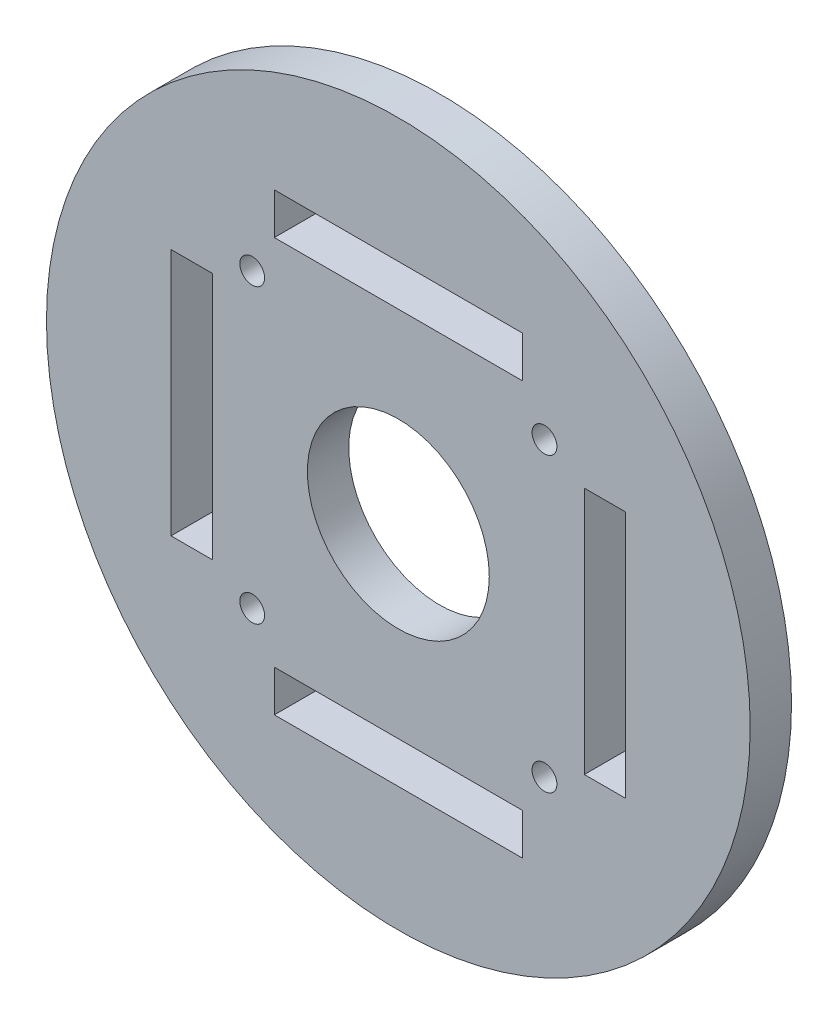
ISO-10303-21;
HEADER;
FILE_DESCRIPTION(('STEP AP214'),'2;1');
FILE_NAME('part.step','',(''),(''),'','','');
FILE_SCHEMA(('AUTOMOTIVE_DESIGN { 1 0 10303 214 1 1 1 1 }'));
ENDSEC;
DATA;
#1=APPLICATION_CONTEXT('core data for automotive mechanical design processes');
#2=APPLICATION_PROTOCOL_DEFINITION('international standard','automotive_design',2000,#1);
#3=PRODUCT_CONTEXT('',#1,'mechanical');
#4=PRODUCT('Part','Part','',(#3));
#5=PRODUCT_RELATED_PRODUCT_CATEGORY('part','',(#4));
#6=PRODUCT_DEFINITION_FORMATION('','',#4);
#7=PRODUCT_DEFINITION_CONTEXT('part definition',#1,'design');
#8=PRODUCT_DEFINITION('design','',#6,#7);
#9=PRODUCT_DEFINITION_SHAPE('','',#8);
#10=(LENGTH_UNIT() NAMED_UNIT(*) SI_UNIT(.MILLI.,.METRE.));
#11=(NAMED_UNIT(*) PLANE_ANGLE_UNIT() SI_UNIT($,.RADIAN.));
#12=(NAMED_UNIT(*) SI_UNIT($,.STERADIAN.) SOLID_ANGLE_UNIT());
#13=UNCERTAINTY_MEASURE_WITH_UNIT(LENGTH_MEASURE(1.E-05),#10,'distance_accuracy_value','');
#14=(GEOMETRIC_REPRESENTATION_CONTEXT(3) GLOBAL_UNCERTAINTY_ASSIGNED_CONTEXT((#13)) GLOBAL_UNIT_ASSIGNED_CONTEXT((#10,
#11,#12)) REPRESENTATION_CONTEXT('',''));
#15=CARTESIAN_POINT('',(0.,0.,0.));
#16=DIRECTION('',(0.,0.,1.));
#17=DIRECTION('',(1.,0.,0.));
#18=AXIS2_PLACEMENT_3D('',#15,#16,#17);
#19=CARTESIAN_POINT('',(0.,0.,5.));
#20=DIRECTION('',(0.,0.,1.));
#21=DIRECTION('',(1.,0.,0.));
#22=AXIS2_PLACEMENT_3D('',#19,#20,#21);
#23=PLANE('',#22);
#24=CARTESIAN_POINT('',(-17.6776695296637,17.6776695296637,5.));
#25=DIRECTION('',(0.,0.,1.));
#26=DIRECTION('',(1.,0.,0.));
#27=AXIS2_PLACEMENT_3D('',#24,#25,#26);
#28=CIRCLE('',#27,1.5);
#29=CARTESIAN_POINT('',(-16.1776695296637,17.6776695296637,5.));
#30=VERTEX_POINT('',#29);
#31=EDGE_CURVE('E323',#30,#30,#28,.T.);
#32=ORIENTED_EDGE('',*,*,#31,.F.);
#33=EDGE_LOOP('',(#32));
#34=FACE_BOUND('',#33,.T.);
#35=CARTESIAN_POINT('',(-17.6776695296637,-17.6776695296637,5.));
#36=DIRECTION('',(0.,0.,1.));
#37=DIRECTION('',(1.,0.,0.));
#38=AXIS2_PLACEMENT_3D('',#35,#36,#37);
#39=CIRCLE('',#38,1.5);
#40=CARTESIAN_POINT('',(-16.1776695296637,-17.6776695296637,5.));
#41=VERTEX_POINT('',#40);
#42=EDGE_CURVE('E176',#41,#41,#39,.T.);
#43=ORIENTED_EDGE('',*,*,#42,.F.);
#44=EDGE_LOOP('',(#43));
#45=FACE_BOUND('',#44,.T.);
#46=CARTESIAN_POINT('',(17.6776695296637,-17.6776695296637,5.));
#47=DIRECTION('',(0.,0.,1.));
#48=DIRECTION('',(1.,0.,0.));
#49=AXIS2_PLACEMENT_3D('',#46,#47,#48);
#50=CIRCLE('',#49,1.5);
#51=CARTESIAN_POINT('',(19.1776695296637,-17.6776695296637,5.));
#52=VERTEX_POINT('',#51);
#53=EDGE_CURVE('E186',#52,#52,#50,.T.);
#54=ORIENTED_EDGE('',*,*,#53,.F.);
#55=EDGE_LOOP('',(#54));
#56=FACE_BOUND('',#55,.T.);
#57=CARTESIAN_POINT('',(17.6776695296637,17.6776695296637,5.));
#58=DIRECTION('',(0.,0.,1.));
#59=DIRECTION('',(1.,0.,0.));
#60=AXIS2_PLACEMENT_3D('',#57,#58,#59);
#61=CIRCLE('',#60,1.5);
#62=CARTESIAN_POINT('',(19.1776695296637,17.6776695296637,5.));
#63=VERTEX_POINT('',#62);
#64=EDGE_CURVE('E192',#63,#63,#61,.T.);
#65=ORIENTED_EDGE('',*,*,#64,.F.);
#66=EDGE_LOOP('',(#65));
#67=FACE_BOUND('',#66,.T.);
#68=CARTESIAN_POINT('',(0.,0.,5.));
#69=DIRECTION('',(0.,0.,1.));
#70=DIRECTION('',(1.,0.,0.));
#71=AXIS2_PLACEMENT_3D('',#68,#69,#70);
#72=CIRCLE('',#71,11.);
#73=CARTESIAN_POINT('',(11.,0.,5.));
#74=VERTEX_POINT('',#73);
#75=EDGE_CURVE('E291',#74,#74,#72,.T.);
#76=ORIENTED_EDGE('',*,*,#75,.F.);
#77=EDGE_LOOP('',(#76));
#78=FACE_BOUND('',#77,.T.);
#79=CARTESIAN_POINT('',(0.,0.,5.));
#80=DIRECTION('',(0.,0.,1.));
#81=DIRECTION('',(1.,0.,0.));
#82=AXIS2_PLACEMENT_3D('',#79,#80,#81);
#83=CIRCLE('',#82,42.5626609388931);
#84=CARTESIAN_POINT('',(42.5626609388931,0.,5.));
#85=VERTEX_POINT('',#84);
#86=EDGE_CURVE('E11',#85,#85,#83,.T.);
#87=ORIENTED_EDGE('',*,*,#86,.T.);
#88=EDGE_LOOP('',(#87));
#89=FACE_BOUND('',#88,.T.);
#90=DIRECTION('',(1.,0.,0.));
#91=VECTOR('',#90,1.);
#92=CARTESIAN_POINT('',(-27.5,-15.,5.));
#93=LINE('',#92,#91);
#94=CARTESIAN_POINT('',(-27.5,-15.,5.));
#95=VERTEX_POINT('',#94);
#96=CARTESIAN_POINT('',(-22.5,-15.,5.));
#97=VERTEX_POINT('',#96);
#98=EDGE_CURVE('E262',#95,#97,#93,.T.);
#99=ORIENTED_EDGE('',*,*,#98,.F.);
#100=DIRECTION('',(0.,-1.,0.));
#101=VECTOR('',#100,1.);
#102=CARTESIAN_POINT('',(-27.5,15.,5.));
#103=LINE('',#102,#101);
#104=CARTESIAN_POINT('',(-27.5,15.,5.));
#105=VERTEX_POINT('',#104);
#106=EDGE_CURVE('E260',#105,#95,#103,.T.);
#107=ORIENTED_EDGE('',*,*,#106,.F.);
#108=DIRECTION('',(-1.,0.,0.));
#109=VECTOR('',#108,1.);
#110=CARTESIAN_POINT('',(-27.5,15.,5.));
#111=LINE('',#110,#109);
#112=CARTESIAN_POINT('',(-22.5,15.,5.));
#113=VERTEX_POINT('',#112);
#114=EDGE_CURVE('E268',#113,#105,#111,.T.);
#115=ORIENTED_EDGE('',*,*,#114,.F.);
#116=DIRECTION('',(0.,1.,0.));
#117=VECTOR('',#116,1.);
#118=CARTESIAN_POINT('',(-22.5,15.,5.));
#119=LINE('',#118,#117);
#120=EDGE_CURVE('E265',#97,#113,#119,.T.);
#121=ORIENTED_EDGE('',*,*,#120,.F.);
#122=EDGE_LOOP('',(#99,#107,#115,#121));
#123=FACE_BOUND('',#122,.T.);
#124=DIRECTION('',(-1.,0.,0.));
#125=VECTOR('',#124,1.);
#126=CARTESIAN_POINT('',(15.0000000000001,27.4999999999999,5.));
#127=LINE('',#126,#125);
#128=CARTESIAN_POINT('',(15.0000000000001,27.4999999999999,5.));
#129=VERTEX_POINT('',#128);
#130=CARTESIAN_POINT('',(-14.9999999999999,27.5,5.));
#131=VERTEX_POINT('',#130);
#132=EDGE_CURVE('E231',#129,#131,#127,.T.);
#133=ORIENTED_EDGE('',*,*,#132,.F.);
#134=DIRECTION('',(0.,1.,0.));
#135=VECTOR('',#134,1.);
#136=CARTESIAN_POINT('',(15.0000000000001,27.4999999999999,5.));
#137=LINE('',#136,#135);
#138=CARTESIAN_POINT('',(15.0000000000001,22.4999999999999,5.));
#139=VERTEX_POINT('',#138);
#140=EDGE_CURVE('E229',#139,#129,#137,.T.);
#141=ORIENTED_EDGE('',*,*,#140,.F.);
#142=DIRECTION('',(1.,0.,0.));
#143=VECTOR('',#142,1.);
#144=CARTESIAN_POINT('',(15.0000000000001,22.4999999999999,5.));
#145=LINE('',#144,#143);
#146=CARTESIAN_POINT('',(-14.9999999999999,22.5,5.));
#147=VERTEX_POINT('',#146);
#148=EDGE_CURVE('E237',#147,#139,#145,.T.);
#149=ORIENTED_EDGE('',*,*,#148,.F.);
#150=DIRECTION('',(0.,-1.,0.));
#151=VECTOR('',#150,1.);
#152=CARTESIAN_POINT('',(-14.9999999999999,27.5,5.));
#153=LINE('',#152,#151);
#154=EDGE_CURVE('E234',#131,#147,#153,.T.);
#155=ORIENTED_EDGE('',*,*,#154,.F.);
#156=EDGE_LOOP('',(#133,#141,#149,#155));
#157=FACE_BOUND('',#156,.T.);
#158=DIRECTION('',(0.,1.,0.));
#159=VECTOR('',#158,1.);
#160=CARTESIAN_POINT('',(27.4999999999999,-15.0000000000002,5.));
#161=LINE('',#160,#159);
#162=CARTESIAN_POINT('',(27.4999999999999,-15.0000000000002,5.));
#163=VERTEX_POINT('',#162);
#164=CARTESIAN_POINT('',(27.5000000000001,14.9999999999998,5.));
#165=VERTEX_POINT('',#164);
#166=EDGE_CURVE('E200',#163,#165,#161,.T.);
#167=ORIENTED_EDGE('',*,*,#166,.F.);
#168=DIRECTION('',(1.,0.,0.));
#169=VECTOR('',#168,1.);
#170=CARTESIAN_POINT('',(27.4999999999999,-15.0000000000002,5.));
#171=LINE('',#170,#169);
#172=CARTESIAN_POINT('',(22.4999999999999,-15.0000000000002,5.));
#173=VERTEX_POINT('',#172);
#174=EDGE_CURVE('E198',#173,#163,#171,.T.);
#175=ORIENTED_EDGE('',*,*,#174,.F.);
#176=DIRECTION('',(0.,-1.,0.));
#177=VECTOR('',#176,1.);
#178=CARTESIAN_POINT('',(22.4999999999999,-15.0000000000002,5.));
#179=LINE('',#178,#177);
#180=CARTESIAN_POINT('',(22.5000000000001,14.9999999999999,5.));
#181=VERTEX_POINT('',#180);
#182=EDGE_CURVE('E206',#181,#173,#179,.T.);
#183=ORIENTED_EDGE('',*,*,#182,.F.);
#184=DIRECTION('',(-1.,0.,0.));
#185=VECTOR('',#184,1.);
#186=CARTESIAN_POINT('',(27.5000000000001,14.9999999999998,5.));
#187=LINE('',#186,#185);
#188=EDGE_CURVE('E203',#165,#181,#187,.T.);
#189=ORIENTED_EDGE('',*,*,#188,.F.);
#190=EDGE_LOOP('',(#167,#175,#183,#189));
#191=FACE_BOUND('',#190,.T.);
#192=DIRECTION('',(1.,0.,0.));
#193=VECTOR('',#192,1.);
#194=CARTESIAN_POINT('',(-15.0000000000003,-27.4999999999998,5.));
#195=LINE('',#194,#193);
#196=CARTESIAN_POINT('',(-15.0000000000003,-27.4999999999998,5.));
#197=VERTEX_POINT('',#196);
#198=CARTESIAN_POINT('',(14.9999999999997,-27.5000000000001,5.));
#199=VERTEX_POINT('',#198);
#200=EDGE_CURVE('E156',#197,#199,#195,.T.);
#201=ORIENTED_EDGE('',*,*,#200,.F.);
#202=DIRECTION('',(0.,-1.,0.));
#203=VECTOR('',#202,1.);
#204=CARTESIAN_POINT('',(-15.0000000000003,-27.4999999999998,5.));
#205=LINE('',#204,#203);
#206=CARTESIAN_POINT('',(-15.0000000000002,-22.4999999999998,5.));
#207=VERTEX_POINT('',#206);
#208=EDGE_CURVE('E148',#207,#197,#205,.T.);
#209=ORIENTED_EDGE('',*,*,#208,.F.);
#210=DIRECTION('',(-1.,0.,0.));
#211=VECTOR('',#210,1.);
#212=CARTESIAN_POINT('',(-15.0000000000002,-22.4999999999998,5.));
#213=LINE('',#212,#211);
#214=CARTESIAN_POINT('',(14.9999999999998,-22.5000000000002,5.));
#215=VERTEX_POINT('',#214);
#216=EDGE_CURVE('E170',#215,#207,#213,.T.);
#217=ORIENTED_EDGE('',*,*,#216,.F.);
#218=DIRECTION('',(0.,1.,0.));
#219=VECTOR('',#218,1.);
#220=CARTESIAN_POINT('',(14.9999999999997,-27.5000000000001,5.));
#221=LINE('',#220,#219);
#222=EDGE_CURVE('E168',#199,#215,#221,.T.);
#223=ORIENTED_EDGE('',*,*,#222,.F.);
#224=EDGE_LOOP('',(#201,#209,#217,#223));
#225=FACE_BOUND('',#224,.T.);
#226=ADVANCED_FACE('F35',(#34,#45,#56,#67,#78,#89,#123,#157,#191,#225),#23,.T.);
#227=CARTESIAN_POINT('',(0.,0.,0.));
#228=DIRECTION('',(0.,0.,1.));
#229=DIRECTION('',(1.,0.,0.));
#230=AXIS2_PLACEMENT_3D('',#227,#228,#229);
#231=PLANE('',#230);
#232=CARTESIAN_POINT('',(-17.6776695296637,17.6776695296637,0.));
#233=DIRECTION('',(0.,0.,1.));
#234=DIRECTION('',(1.,0.,0.));
#235=AXIS2_PLACEMENT_3D('',#232,#233,#234);
#236=CIRCLE('',#235,1.5);
#237=CARTESIAN_POINT('',(-16.1776695296637,17.6776695296637,0.));
#238=VERTEX_POINT('',#237);
#239=EDGE_CURVE('E531',#238,#238,#236,.T.);
#240=ORIENTED_EDGE('',*,*,#239,.T.);
#241=EDGE_LOOP('',(#240));
#242=FACE_BOUND('',#241,.T.);
#243=CARTESIAN_POINT('',(-17.6776695296637,-17.6776695296637,0.));
#244=DIRECTION('',(0.,0.,1.));
#245=DIRECTION('',(1.,0.,0.));
#246=AXIS2_PLACEMENT_3D('',#243,#244,#245);
#247=CIRCLE('',#246,1.5);
#248=CARTESIAN_POINT('',(-16.1776695296637,-17.6776695296637,0.));
#249=VERTEX_POINT('',#248);
#250=EDGE_CURVE('E533',#249,#249,#247,.T.);
#251=ORIENTED_EDGE('',*,*,#250,.T.);
#252=EDGE_LOOP('',(#251));
#253=FACE_BOUND('',#252,.T.);
#254=DIRECTION('',(1.,0.,0.));
#255=VECTOR('',#254,1.);
#256=CARTESIAN_POINT('',(27.4999999999999,-15.0000000000002,0.));
#257=LINE('',#256,#255);
#258=CARTESIAN_POINT('',(22.4999999999999,-15.0000000000002,0.));
#259=VERTEX_POINT('',#258);
#260=CARTESIAN_POINT('',(27.4999999999999,-15.0000000000002,0.));
#261=VERTEX_POINT('',#260);
#262=EDGE_CURVE('E195',#259,#261,#257,.T.);
#263=ORIENTED_EDGE('',*,*,#262,.T.);
#264=DIRECTION('',(0.,1.,0.));
#265=VECTOR('',#264,1.);
#266=CARTESIAN_POINT('',(27.4999999999999,-15.0000000000002,0.));
#267=LINE('',#266,#265);
#268=CARTESIAN_POINT('',(27.5000000000001,14.9999999999998,0.));
#269=VERTEX_POINT('',#268);
#270=EDGE_CURVE('E211',#261,#269,#267,.T.);
#271=ORIENTED_EDGE('',*,*,#270,.T.);
#272=DIRECTION('',(-1.,0.,0.));
#273=VECTOR('',#272,1.);
#274=CARTESIAN_POINT('',(27.5000000000001,14.9999999999998,0.));
#275=LINE('',#274,#273);
#276=CARTESIAN_POINT('',(22.5000000000001,14.9999999999999,0.));
#277=VERTEX_POINT('',#276);
#278=EDGE_CURVE('E214',#269,#277,#275,.T.);
#279=ORIENTED_EDGE('',*,*,#278,.T.);
#280=DIRECTION('',(0.,-1.,0.));
#281=VECTOR('',#280,1.);
#282=CARTESIAN_POINT('',(22.4999999999999,-15.0000000000002,0.));
#283=LINE('',#282,#281);
#284=EDGE_CURVE('E201',#277,#259,#283,.T.);
#285=ORIENTED_EDGE('',*,*,#284,.T.);
#286=EDGE_LOOP('',(#263,#271,#279,#285));
#287=FACE_BOUND('',#286,.T.);
#288=DIRECTION('',(0.,-1.,0.));
#289=VECTOR('',#288,1.);
#290=CARTESIAN_POINT('',(-27.5,15.,0.));
#291=LINE('',#290,#289);
#292=CARTESIAN_POINT('',(-27.5,15.,0.));
#293=VERTEX_POINT('',#292);
#294=CARTESIAN_POINT('',(-27.5,-15.,0.));
#295=VERTEX_POINT('',#294);
#296=EDGE_CURVE('E259',#293,#295,#291,.T.);
#297=ORIENTED_EDGE('',*,*,#296,.T.);
#298=DIRECTION('',(1.,0.,0.));
#299=VECTOR('',#298,1.);
#300=CARTESIAN_POINT('',(-27.5,-15.,0.));
#301=LINE('',#300,#299);
#302=CARTESIAN_POINT('',(-22.5,-15.,0.));
#303=VERTEX_POINT('',#302);
#304=EDGE_CURVE('E273',#295,#303,#301,.T.);
#305=ORIENTED_EDGE('',*,*,#304,.T.);
#306=DIRECTION('',(0.,1.,0.));
#307=VECTOR('',#306,1.);
#308=CARTESIAN_POINT('',(-22.5,15.,0.));
#309=LINE('',#308,#307);
#310=CARTESIAN_POINT('',(-22.5,15.,0.));
#311=VERTEX_POINT('',#310);
#312=EDGE_CURVE('E276',#303,#311,#309,.T.);
#313=ORIENTED_EDGE('',*,*,#312,.T.);
#314=DIRECTION('',(-1.,0.,0.));
#315=VECTOR('',#314,1.);
#316=CARTESIAN_POINT('',(-27.5,15.,0.));
#317=LINE('',#316,#315);
#318=EDGE_CURVE('E263',#311,#293,#317,.T.);
#319=ORIENTED_EDGE('',*,*,#318,.T.);
#320=EDGE_LOOP('',(#297,#305,#313,#319));
#321=FACE_BOUND('',#320,.T.);
#322=CARTESIAN_POINT('',(0.,0.,0.));
#323=DIRECTION('',(0.,0.,1.));
#324=DIRECTION('',(1.,0.,0.));
#325=AXIS2_PLACEMENT_3D('',#322,#323,#324);
#326=CIRCLE('',#325,11.);
#327=CARTESIAN_POINT('',(11.,0.,0.));
#328=VERTEX_POINT('',#327);
#329=EDGE_CURVE('E290',#328,#328,#326,.T.);
#330=ORIENTED_EDGE('',*,*,#329,.T.);
#331=EDGE_LOOP('',(#330));
#332=FACE_BOUND('',#331,.T.);
#333=CARTESIAN_POINT('',(0.,0.,0.));
#334=DIRECTION('',(0.,0.,1.));
#335=DIRECTION('',(1.,0.,0.));
#336=AXIS2_PLACEMENT_3D('',#333,#334,#335);
#337=CIRCLE('',#336,42.5626609388931);
#338=CARTESIAN_POINT('',(42.5626609388931,0.,0.));
#339=VERTEX_POINT('',#338);
#340=EDGE_CURVE('E39',#339,#339,#337,.T.);
#341=ORIENTED_EDGE('',*,*,#340,.F.);
#342=EDGE_LOOP('',(#341));
#343=FACE_BOUND('',#342,.T.);
#344=DIRECTION('',(0.,1.,0.));
#345=VECTOR('',#344,1.);
#346=CARTESIAN_POINT('',(15.0000000000001,27.4999999999999,0.));
#347=LINE('',#346,#345);
#348=CARTESIAN_POINT('',(15.0000000000001,22.4999999999999,0.));
#349=VERTEX_POINT('',#348);
#350=CARTESIAN_POINT('',(15.0000000000001,27.4999999999999,0.));
#351=VERTEX_POINT('',#350);
#352=EDGE_CURVE('E228',#349,#351,#347,.T.);
#353=ORIENTED_EDGE('',*,*,#352,.T.);
#354=DIRECTION('',(-1.,0.,0.));
#355=VECTOR('',#354,1.);
#356=CARTESIAN_POINT('',(15.0000000000001,27.4999999999999,0.));
#357=LINE('',#356,#355);
#358=CARTESIAN_POINT('',(-14.9999999999999,27.5,0.));
#359=VERTEX_POINT('',#358);
#360=EDGE_CURVE('E242',#351,#359,#357,.T.);
#361=ORIENTED_EDGE('',*,*,#360,.T.);
#362=DIRECTION('',(0.,-1.,0.));
#363=VECTOR('',#362,1.);
#364=CARTESIAN_POINT('',(-14.9999999999999,27.5,0.));
#365=LINE('',#364,#363);
#366=CARTESIAN_POINT('',(-14.9999999999999,22.5,0.));
#367=VERTEX_POINT('',#366);
#368=EDGE_CURVE('E245',#359,#367,#365,.T.);
#369=ORIENTED_EDGE('',*,*,#368,.T.);
#370=DIRECTION('',(1.,0.,0.));
#371=VECTOR('',#370,1.);
#372=CARTESIAN_POINT('',(15.0000000000001,22.4999999999999,0.));
#373=LINE('',#372,#371);
#374=EDGE_CURVE('E232',#367,#349,#373,.T.);
#375=ORIENTED_EDGE('',*,*,#374,.T.);
#376=EDGE_LOOP('',(#353,#361,#369,#375));
#377=FACE_BOUND('',#376,.T.);
#378=CARTESIAN_POINT('',(17.6776695296637,17.6776695296637,0.));
#379=DIRECTION('',(0.,0.,1.));
#380=DIRECTION('',(1.,0.,0.));
#381=AXIS2_PLACEMENT_3D('',#378,#379,#380);
#382=CIRCLE('',#381,1.5);
#383=CARTESIAN_POINT('',(19.1776695296637,17.6776695296637,0.));
#384=VERTEX_POINT('',#383);
#385=EDGE_CURVE('E189',#384,#384,#382,.T.);
#386=ORIENTED_EDGE('',*,*,#385,.T.);
#387=EDGE_LOOP('',(#386));
#388=FACE_BOUND('',#387,.T.);
#389=CARTESIAN_POINT('',(17.6776695296637,-17.6776695296637,0.));
#390=DIRECTION('',(0.,0.,1.));
#391=DIRECTION('',(1.,0.,0.));
#392=AXIS2_PLACEMENT_3D('',#389,#390,#391);
#393=CIRCLE('',#392,1.5);
#394=CARTESIAN_POINT('',(19.1776695296637,-17.6776695296637,0.));
#395=VERTEX_POINT('',#394);
#396=EDGE_CURVE('E164',#395,#395,#393,.T.);
#397=ORIENTED_EDGE('',*,*,#396,.T.);
#398=EDGE_LOOP('',(#397));
#399=FACE_BOUND('',#398,.T.);
#400=DIRECTION('',(0.,-1.,0.));
#401=VECTOR('',#400,1.);
#402=CARTESIAN_POINT('',(-15.0000000000003,-27.4999999999998,0.));
#403=LINE('',#402,#401);
#404=CARTESIAN_POINT('',(-15.0000000000002,-22.4999999999998,0.));
#405=VERTEX_POINT('',#404);
#406=CARTESIAN_POINT('',(-15.0000000000003,-27.4999999999998,0.));
#407=VERTEX_POINT('',#406);
#408=EDGE_CURVE('E58',#405,#407,#403,.T.);
#409=ORIENTED_EDGE('',*,*,#408,.T.);
#410=DIRECTION('',(1.,0.,0.));
#411=VECTOR('',#410,1.);
#412=CARTESIAN_POINT('',(-15.0000000000003,-27.4999999999998,0.));
#413=LINE('',#412,#411);
#414=CARTESIAN_POINT('',(14.9999999999997,-27.5000000000001,0.));
#415=VERTEX_POINT('',#414);
#416=EDGE_CURVE('E163',#407,#415,#413,.T.);
#417=ORIENTED_EDGE('',*,*,#416,.T.);
#418=DIRECTION('',(0.,1.,0.));
#419=VECTOR('',#418,1.);
#420=CARTESIAN_POINT('',(14.9999999999997,-27.5000000000001,0.));
#421=LINE('',#420,#419);
#422=CARTESIAN_POINT('',(14.9999999999998,-22.5000000000001,0.));
#423=VERTEX_POINT('',#422);
#424=EDGE_CURVE('E178',#415,#423,#421,.T.);
#425=ORIENTED_EDGE('',*,*,#424,.T.);
#426=DIRECTION('',(-1.,0.,0.));
#427=VECTOR('',#426,1.);
#428=CARTESIAN_POINT('',(-15.0000000000002,-22.4999999999998,0.));
#429=LINE('',#428,#427);
#430=EDGE_CURVE('E157',#423,#405,#429,.T.);
#431=ORIENTED_EDGE('',*,*,#430,.T.);
#432=EDGE_LOOP('',(#409,#417,#425,#431));
#433=FACE_BOUND('',#432,.T.);
#434=ADVANCED_FACE('F297',(#242,#253,#287,#321,#332,#343,#377,#388,#399,#433),#231,.F.);
#435=CARTESIAN_POINT('',(0.,0.,5.));
#436=DIRECTION('',(0.,0.,-1.));
#437=DIRECTION('',(-1.,0.,0.));
#438=AXIS2_PLACEMENT_3D('',#435,#436,#437);
#439=CYLINDRICAL_SURFACE('',#438,42.5626609388931);
#440=ORIENTED_EDGE('',*,*,#86,.F.);
#441=EDGE_LOOP('',(#440));
#442=FACE_BOUND('',#441,.T.);
#443=ORIENTED_EDGE('',*,*,#340,.T.);
#444=EDGE_LOOP('',(#443));
#445=FACE_BOUND('',#444,.T.);
#446=ADVANCED_FACE('F37',(#442,#445),#439,.T.);
#447=CARTESIAN_POINT('',(0.,0.,5.));
#448=DIRECTION('',(0.,0.,-1.));
#449=DIRECTION('',(-1.,0.,0.));
#450=AXIS2_PLACEMENT_3D('',#447,#448,#449);
#451=CYLINDRICAL_SURFACE('',#450,11.);
#452=ORIENTED_EDGE('',*,*,#75,.T.);
#453=EDGE_LOOP('',(#452));
#454=FACE_BOUND('',#453,.T.);
#455=ORIENTED_EDGE('',*,*,#329,.F.);
#456=EDGE_LOOP('',(#455));
#457=FACE_BOUND('',#456,.T.);
#458=ADVANCED_FACE('F300',(#454,#457),#451,.F.);
#459=CARTESIAN_POINT('',(-27.5,15.,5.));
#460=DIRECTION('',(1.,0.,0.));
#461=DIRECTION('',(0.,1.,0.));
#462=AXIS2_PLACEMENT_3D('',#459,#460,#461);
#463=PLANE('',#462);
#464=ORIENTED_EDGE('',*,*,#296,.F.);
#465=DIRECTION('',(0.,0.,-1.));
#466=VECTOR('',#465,1.);
#467=CARTESIAN_POINT('',(-27.5,15.,5.));
#468=LINE('',#467,#466);
#469=EDGE_CURVE('E270',#105,#293,#468,.T.);
#470=ORIENTED_EDGE('',*,*,#469,.F.);
#471=ORIENTED_EDGE('',*,*,#106,.T.);
#472=DIRECTION('',(0.,0.,-1.));
#473=VECTOR('',#472,1.);
#474=CARTESIAN_POINT('',(-27.5,-15.,5.));
#475=LINE('',#474,#473);
#476=EDGE_CURVE('E287',#95,#295,#475,.T.);
#477=ORIENTED_EDGE('',*,*,#476,.T.);
#478=EDGE_LOOP('',(#464,#470,#471,#477));
#479=FACE_BOUND('',#478,.T.);
#480=ADVANCED_FACE('F302',(#479),#463,.T.);
#481=CARTESIAN_POINT('',(-27.5,-15.,5.));
#482=DIRECTION('',(0.,1.,0.));
#483=DIRECTION('',(-1.,0.,0.));
#484=AXIS2_PLACEMENT_3D('',#481,#482,#483);
#485=PLANE('',#484);
#486=ORIENTED_EDGE('',*,*,#304,.F.);
#487=ORIENTED_EDGE('',*,*,#476,.F.);
#488=ORIENTED_EDGE('',*,*,#98,.T.);
#489=DIRECTION('',(0.,0.,-1.));
#490=VECTOR('',#489,1.);
#491=CARTESIAN_POINT('',(-22.5,-15.,5.));
#492=LINE('',#491,#490);
#493=EDGE_CURVE('E285',#97,#303,#492,.T.);
#494=ORIENTED_EDGE('',*,*,#493,.T.);
#495=EDGE_LOOP('',(#486,#487,#488,#494));
#496=FACE_BOUND('',#495,.T.);
#497=ADVANCED_FACE('F309',(#496),#485,.T.);
#498=CARTESIAN_POINT('',(-22.5,15.,5.));
#499=DIRECTION('',(-1.,0.,0.));
#500=DIRECTION('',(0.,-1.,0.));
#501=AXIS2_PLACEMENT_3D('',#498,#499,#500);
#502=PLANE('',#501);
#503=ORIENTED_EDGE('',*,*,#312,.F.);
#504=ORIENTED_EDGE('',*,*,#493,.F.);
#505=ORIENTED_EDGE('',*,*,#120,.T.);
#506=DIRECTION('',(0.,0.,-1.));
#507=VECTOR('',#506,1.);
#508=CARTESIAN_POINT('',(-22.5,15.,5.));
#509=LINE('',#508,#507);
#510=EDGE_CURVE('E283',#113,#311,#509,.T.);
#511=ORIENTED_EDGE('',*,*,#510,.T.);
#512=EDGE_LOOP('',(#503,#504,#505,#511));
#513=FACE_BOUND('',#512,.T.);
#514=ADVANCED_FACE('F398',(#513),#502,.T.);
#515=CARTESIAN_POINT('',(-27.5,15.,5.));
#516=DIRECTION('',(0.,-1.,0.));
#517=DIRECTION('',(1.,0.,0.));
#518=AXIS2_PLACEMENT_3D('',#515,#516,#517);
#519=PLANE('',#518);
#520=ORIENTED_EDGE('',*,*,#318,.F.);
#521=ORIENTED_EDGE('',*,*,#510,.F.);
#522=ORIENTED_EDGE('',*,*,#114,.T.);
#523=ORIENTED_EDGE('',*,*,#469,.T.);
#524=EDGE_LOOP('',(#520,#521,#522,#523));
#525=FACE_BOUND('',#524,.T.);
#526=ADVANCED_FACE('F394',(#525),#519,.T.);
#527=CARTESIAN_POINT('',(15.0000000000001,27.4999999999999,5.));
#528=DIRECTION('',(-1.,0.,0.));
#529=DIRECTION('',(0.,-1.,0.));
#530=AXIS2_PLACEMENT_3D('',#527,#528,#529);
#531=PLANE('',#530);
#532=ORIENTED_EDGE('',*,*,#352,.F.);
#533=DIRECTION('',(0.,0.,-1.));
#534=VECTOR('',#533,1.);
#535=CARTESIAN_POINT('',(15.0000000000001,22.4999999999999,5.));
#536=LINE('',#535,#534);
#537=EDGE_CURVE('E239',#139,#349,#536,.T.);
#538=ORIENTED_EDGE('',*,*,#537,.F.);
#539=ORIENTED_EDGE('',*,*,#140,.T.);
#540=DIRECTION('',(0.,0.,-1.));
#541=VECTOR('',#540,1.);
#542=CARTESIAN_POINT('',(15.0000000000001,27.4999999999999,5.));
#543=LINE('',#542,#541);
#544=EDGE_CURVE('E256',#129,#351,#543,.T.);
#545=ORIENTED_EDGE('',*,*,#544,.T.);
#546=EDGE_LOOP('',(#532,#538,#539,#545));
#547=FACE_BOUND('',#546,.T.);
#548=ADVANCED_FACE('F390',(#547),#531,.T.);
#549=CARTESIAN_POINT('',(15.0000000000001,27.4999999999999,5.));
#550=DIRECTION('',(0.,-1.,0.));
#551=DIRECTION('',(1.,0.,0.));
#552=AXIS2_PLACEMENT_3D('',#549,#550,#551);
#553=PLANE('',#552);
#554=ORIENTED_EDGE('',*,*,#360,.F.);
#555=ORIENTED_EDGE('',*,*,#544,.F.);
#556=ORIENTED_EDGE('',*,*,#132,.T.);
#557=DIRECTION('',(0.,0.,-1.));
#558=VECTOR('',#557,1.);
#559=CARTESIAN_POINT('',(-14.9999999999999,27.5,5.));
#560=LINE('',#559,#558);
#561=EDGE_CURVE('E254',#131,#359,#560,.T.);
#562=ORIENTED_EDGE('',*,*,#561,.T.);
#563=EDGE_LOOP('',(#554,#555,#556,#562));
#564=FACE_BOUND('',#563,.T.);
#565=ADVANCED_FACE('F386',(#564),#553,.T.);
#566=CARTESIAN_POINT('',(-14.9999999999999,27.5,5.));
#567=DIRECTION('',(1.,0.,0.));
#568=DIRECTION('',(0.,1.,0.));
#569=AXIS2_PLACEMENT_3D('',#566,#567,#568);
#570=PLANE('',#569);
#571=ORIENTED_EDGE('',*,*,#368,.F.);
#572=ORIENTED_EDGE('',*,*,#561,.F.);
#573=ORIENTED_EDGE('',*,*,#154,.T.);
#574=DIRECTION('',(0.,0.,-1.));
#575=VECTOR('',#574,1.);
#576=CARTESIAN_POINT('',(-14.9999999999999,22.5,5.));
#577=LINE('',#576,#575);
#578=EDGE_CURVE('E252',#147,#367,#577,.T.);
#579=ORIENTED_EDGE('',*,*,#578,.T.);
#580=EDGE_LOOP('',(#571,#572,#573,#579));
#581=FACE_BOUND('',#580,.T.);
#582=ADVANCED_FACE('F382',(#581),#570,.T.);
#583=CARTESIAN_POINT('',(15.0000000000001,22.4999999999999,5.));
#584=DIRECTION('',(0.,1.,0.));
#585=DIRECTION('',(-1.,0.,0.));
#586=AXIS2_PLACEMENT_3D('',#583,#584,#585);
#587=PLANE('',#586);
#588=ORIENTED_EDGE('',*,*,#374,.F.);
#589=ORIENTED_EDGE('',*,*,#578,.F.);
#590=ORIENTED_EDGE('',*,*,#148,.T.);
#591=ORIENTED_EDGE('',*,*,#537,.T.);
#592=EDGE_LOOP('',(#588,#589,#590,#591));
#593=FACE_BOUND('',#592,.T.);
#594=ADVANCED_FACE('F379',(#593),#587,.T.);
#595=CARTESIAN_POINT('',(27.4999999999999,-15.0000000000002,5.));
#596=DIRECTION('',(0.,1.,0.));
#597=DIRECTION('',(-1.,0.,0.));
#598=AXIS2_PLACEMENT_3D('',#595,#596,#597);
#599=PLANE('',#598);
#600=ORIENTED_EDGE('',*,*,#262,.F.);
#601=DIRECTION('',(0.,0.,-1.));
#602=VECTOR('',#601,1.);
#603=CARTESIAN_POINT('',(22.4999999999999,-15.0000000000002,5.));
#604=LINE('',#603,#602);
#605=EDGE_CURVE('E208',#173,#259,#604,.T.);
#606=ORIENTED_EDGE('',*,*,#605,.F.);
#607=ORIENTED_EDGE('',*,*,#174,.T.);
#608=DIRECTION('',(0.,0.,-1.));
#609=VECTOR('',#608,1.);
#610=CARTESIAN_POINT('',(27.4999999999999,-15.0000000000002,5.));
#611=LINE('',#610,#609);
#612=EDGE_CURVE('E225',#163,#261,#611,.T.);
#613=ORIENTED_EDGE('',*,*,#612,.T.);
#614=EDGE_LOOP('',(#600,#606,#607,#613));
#615=FACE_BOUND('',#614,.T.);
#616=ADVANCED_FACE('F358',(#615),#599,.T.);
#617=CARTESIAN_POINT('',(27.4999999999999,-15.0000000000002,5.));
#618=DIRECTION('',(-1.,0.,0.));
#619=DIRECTION('',(0.,-1.,0.));
#620=AXIS2_PLACEMENT_3D('',#617,#618,#619);
#621=PLANE('',#620);
#622=ORIENTED_EDGE('',*,*,#270,.F.);
#623=ORIENTED_EDGE('',*,*,#612,.F.);
#624=ORIENTED_EDGE('',*,*,#166,.T.);
#625=DIRECTION('',(0.,0.,-1.));
#626=VECTOR('',#625,1.);
#627=CARTESIAN_POINT('',(27.5000000000001,14.9999999999998,5.));
#628=LINE('',#627,#626);
#629=EDGE_CURVE('E223',#165,#269,#628,.T.);
#630=ORIENTED_EDGE('',*,*,#629,.T.);
#631=EDGE_LOOP('',(#622,#623,#624,#630));
#632=FACE_BOUND('',#631,.T.);
#633=ADVANCED_FACE('F350',(#632),#621,.T.);
#634=CARTESIAN_POINT('',(27.5000000000001,14.9999999999998,5.));
#635=DIRECTION('',(0.,-1.,0.));
#636=DIRECTION('',(1.,0.,0.));
#637=AXIS2_PLACEMENT_3D('',#634,#635,#636);
#638=PLANE('',#637);
#639=ORIENTED_EDGE('',*,*,#278,.F.);
#640=ORIENTED_EDGE('',*,*,#629,.F.);
#641=ORIENTED_EDGE('',*,*,#188,.T.);
#642=DIRECTION('',(0.,0.,-1.));
#643=VECTOR('',#642,1.);
#644=CARTESIAN_POINT('',(22.5000000000001,14.9999999999999,5.));
#645=LINE('',#644,#643);
#646=EDGE_CURVE('E221',#181,#277,#645,.T.);
#647=ORIENTED_EDGE('',*,*,#646,.T.);
#648=EDGE_LOOP('',(#639,#640,#641,#647));
#649=FACE_BOUND('',#648,.T.);
#650=ADVANCED_FACE('F353',(#649),#638,.T.);
#651=CARTESIAN_POINT('',(22.4999999999999,-15.0000000000002,5.));
#652=DIRECTION('',(1.,0.,0.));
#653=DIRECTION('',(0.,1.,0.));
#654=AXIS2_PLACEMENT_3D('',#651,#652,#653);
#655=PLANE('',#654);
#656=ORIENTED_EDGE('',*,*,#284,.F.);
#657=ORIENTED_EDGE('',*,*,#646,.F.);
#658=ORIENTED_EDGE('',*,*,#182,.T.);
#659=ORIENTED_EDGE('',*,*,#605,.T.);
#660=EDGE_LOOP('',(#656,#657,#658,#659));
#661=FACE_BOUND('',#660,.T.);
#662=ADVANCED_FACE('F361',(#661),#655,.T.);
#663=CARTESIAN_POINT('',(17.6776695296637,17.6776695296637,5.));
#664=DIRECTION('',(0.,0.,-1.));
#665=DIRECTION('',(-1.,0.,0.));
#666=AXIS2_PLACEMENT_3D('',#663,#664,#665);
#667=CYLINDRICAL_SURFACE('',#666,1.5);
#668=ORIENTED_EDGE('',*,*,#64,.T.);
#669=EDGE_LOOP('',(#668));
#670=FACE_BOUND('',#669,.T.);
#671=ORIENTED_EDGE('',*,*,#385,.F.);
#672=EDGE_LOOP('',(#671));
#673=FACE_BOUND('',#672,.T.);
#674=ADVANCED_FACE('F363',(#670,#673),#667,.F.);
#675=CARTESIAN_POINT('',(17.6776695296637,-17.6776695296637,5.));
#676=DIRECTION('',(0.,0.,-1.));
#677=DIRECTION('',(-1.,0.,0.));
#678=AXIS2_PLACEMENT_3D('',#675,#676,#677);
#679=CYLINDRICAL_SURFACE('',#678,1.5);
#680=ORIENTED_EDGE('',*,*,#53,.T.);
#681=EDGE_LOOP('',(#680));
#682=FACE_BOUND('',#681,.T.);
#683=ORIENTED_EDGE('',*,*,#396,.F.);
#684=EDGE_LOOP('',(#683));
#685=FACE_BOUND('',#684,.T.);
#686=ADVANCED_FACE('F369',(#682,#685),#679,.F.);
#687=CARTESIAN_POINT('',(-15.0000000000003,-27.4999999999998,5.));
#688=DIRECTION('',(1.,0.,0.));
#689=DIRECTION('',(0.,1.,0.));
#690=AXIS2_PLACEMENT_3D('',#687,#688,#689);
#691=PLANE('',#690);
#692=ORIENTED_EDGE('',*,*,#408,.F.);
#693=DIRECTION('',(0.,0.,-1.));
#694=VECTOR('',#693,1.);
#695=CARTESIAN_POINT('',(-15.0000000000002,-22.4999999999998,5.));
#696=LINE('',#695,#694);
#697=EDGE_CURVE('E152',#207,#405,#696,.T.);
#698=ORIENTED_EDGE('',*,*,#697,.F.);
#699=ORIENTED_EDGE('',*,*,#208,.T.);
#700=DIRECTION('',(0.,0.,-1.));
#701=VECTOR('',#700,1.);
#702=CARTESIAN_POINT('',(-15.0000000000003,-27.4999999999998,5.));
#703=LINE('',#702,#701);
#704=EDGE_CURVE('E151',#197,#407,#703,.T.);
#705=ORIENTED_EDGE('',*,*,#704,.T.);
#706=EDGE_LOOP('',(#692,#698,#699,#705));
#707=FACE_BOUND('',#706,.T.);
#708=ADVANCED_FACE('F150',(#707),#691,.T.);
#709=CARTESIAN_POINT('',(-15.0000000000003,-27.4999999999998,5.));
#710=DIRECTION('',(0.,1.,0.));
#711=DIRECTION('',(-1.,0.,0.));
#712=AXIS2_PLACEMENT_3D('',#709,#710,#711);
#713=PLANE('',#712);
#714=ORIENTED_EDGE('',*,*,#416,.F.);
#715=ORIENTED_EDGE('',*,*,#704,.F.);
#716=ORIENTED_EDGE('',*,*,#200,.T.);
#717=DIRECTION('',(0.,0.,-1.));
#718=VECTOR('',#717,1.);
#719=CARTESIAN_POINT('',(14.9999999999997,-27.5000000000001,5.));
#720=LINE('',#719,#718);
#721=EDGE_CURVE('E165',#199,#415,#720,.T.);
#722=ORIENTED_EDGE('',*,*,#721,.T.);
#723=EDGE_LOOP('',(#714,#715,#716,#722));
#724=FACE_BOUND('',#723,.T.);
#725=ADVANCED_FACE('F160',(#724),#713,.T.);
#726=CARTESIAN_POINT('',(14.9999999999997,-27.5000000000001,5.));
#727=DIRECTION('',(-1.,0.,0.));
#728=DIRECTION('',(0.,-1.,0.));
#729=AXIS2_PLACEMENT_3D('',#726,#727,#728);
#730=PLANE('',#729);
#731=ORIENTED_EDGE('',*,*,#424,.F.);
#732=ORIENTED_EDGE('',*,*,#721,.F.);
#733=ORIENTED_EDGE('',*,*,#222,.T.);
#734=DIRECTION('',(0.,0.,-1.));
#735=VECTOR('',#734,1.);
#736=CARTESIAN_POINT('',(14.9999999999998,-22.5000000000001,5.));
#737=LINE('',#736,#735);
#738=EDGE_CURVE('E50',#215,#423,#737,.T.);
#739=ORIENTED_EDGE('',*,*,#738,.T.);
#740=EDGE_LOOP('',(#731,#732,#733,#739));
#741=FACE_BOUND('',#740,.T.);
#742=ADVANCED_FACE('F486',(#741),#730,.T.);
#743=CARTESIAN_POINT('',(-15.0000000000002,-22.4999999999998,5.));
#744=DIRECTION('',(0.,-1.,0.));
#745=DIRECTION('',(1.,0.,0.));
#746=AXIS2_PLACEMENT_3D('',#743,#744,#745);
#747=PLANE('',#746);
#748=ORIENTED_EDGE('',*,*,#430,.F.);
#749=ORIENTED_EDGE('',*,*,#738,.F.);
#750=ORIENTED_EDGE('',*,*,#216,.T.);
#751=ORIENTED_EDGE('',*,*,#697,.T.);
#752=EDGE_LOOP('',(#748,#749,#750,#751));
#753=FACE_BOUND('',#752,.T.);
#754=ADVANCED_FACE('F495',(#753),#747,.T.);
#755=CARTESIAN_POINT('',(-17.6776695296637,-17.6776695296637,5.));
#756=DIRECTION('',(0.,0.,-1.));
#757=DIRECTION('',(-1.,0.,0.));
#758=AXIS2_PLACEMENT_3D('',#755,#756,#757);
#759=CYLINDRICAL_SURFACE('',#758,1.5);
#760=ORIENTED_EDGE('',*,*,#42,.T.);
#761=EDGE_LOOP('',(#760));
#762=FACE_BOUND('',#761,.T.);
#763=ORIENTED_EDGE('',*,*,#250,.F.);
#764=EDGE_LOOP('',(#763));
#765=FACE_BOUND('',#764,.T.);
#766=ADVANCED_FACE('F505',(#762,#765),#759,.F.);
#767=CARTESIAN_POINT('',(-17.6776695296637,17.6776695296637,5.));
#768=DIRECTION('',(0.,0.,-1.));
#769=DIRECTION('',(-1.,0.,0.));
#770=AXIS2_PLACEMENT_3D('',#767,#768,#769);
#771=CYLINDRICAL_SURFACE('',#770,1.5);
#772=ORIENTED_EDGE('',*,*,#31,.T.);
#773=EDGE_LOOP('',(#772));
#774=FACE_BOUND('',#773,.T.);
#775=ORIENTED_EDGE('',*,*,#239,.F.);
#776=EDGE_LOOP('',(#775));
#777=FACE_BOUND('',#776,.T.);
#778=ADVANCED_FACE('F514',(#774,#777),#771,.F.);
#779=CLOSED_SHELL('',(#226,#434,#446,#458,#480,#497,#514,#526,#548,#565,#582,#594,#616,#633,
#650,#662,#674,#686,#708,#725,#742,#754,#766,#778));
#780=MANIFOLD_SOLID_BREP('B2',#779);
#781=ADVANCED_BREP_SHAPE_REPRESENTATION('',(#18,#780),#14);
#782=SHAPE_DEFINITION_REPRESENTATION(#9,#781);
ENDSEC;
END-ISO-10303-21;
